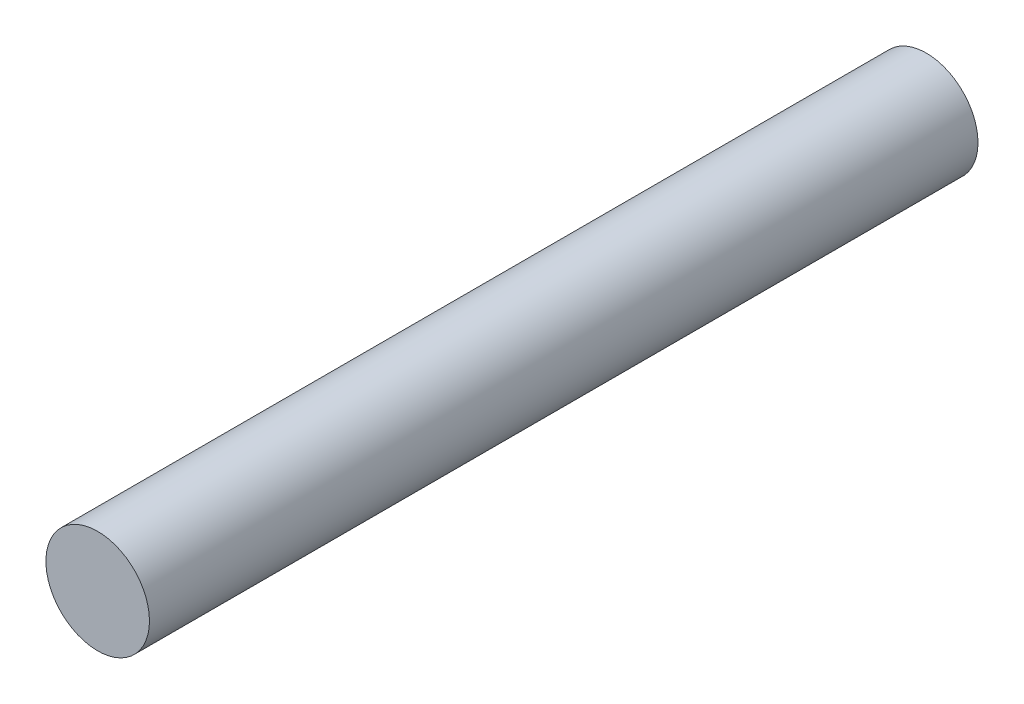
ISO-10303-21;
HEADER;
FILE_DESCRIPTION(('STEP AP214'),'2;1');
FILE_NAME('part.step','',(''),(''),'','','');
FILE_SCHEMA(('AUTOMOTIVE_DESIGN { 1 0 10303 214 1 1 1 1 }'));
ENDSEC;
DATA;
#1=APPLICATION_CONTEXT('core data for automotive mechanical design processes');
#2=APPLICATION_PROTOCOL_DEFINITION('international standard','automotive_design',2000,#1);
#3=PRODUCT_CONTEXT('',#1,'mechanical');
#4=PRODUCT('Part','Part','',(#3));
#5=PRODUCT_RELATED_PRODUCT_CATEGORY('part','',(#4));
#6=PRODUCT_DEFINITION_FORMATION('','',#4);
#7=PRODUCT_DEFINITION_CONTEXT('part definition',#1,'design');
#8=PRODUCT_DEFINITION('design','',#6,#7);
#9=PRODUCT_DEFINITION_SHAPE('','',#8);
#10=(LENGTH_UNIT() NAMED_UNIT(*) SI_UNIT(.MILLI.,.METRE.));
#11=(NAMED_UNIT(*) PLANE_ANGLE_UNIT() SI_UNIT($,.RADIAN.));
#12=(NAMED_UNIT(*) SI_UNIT($,.STERADIAN.) SOLID_ANGLE_UNIT());
#13=UNCERTAINTY_MEASURE_WITH_UNIT(LENGTH_MEASURE(1.E-05),#10,'distance_accuracy_value','');
#14=(GEOMETRIC_REPRESENTATION_CONTEXT(3) GLOBAL_UNCERTAINTY_ASSIGNED_CONTEXT((#13)) GLOBAL_UNIT_ASSIGNED_CONTEXT((#10,
#11,#12)) REPRESENTATION_CONTEXT('',''));
#15=CARTESIAN_POINT('',(0.,0.,0.));
#16=DIRECTION('',(0.,0.,1.));
#17=DIRECTION('',(1.,0.,0.));
#18=AXIS2_PLACEMENT_3D('',#15,#16,#17);
#19=CARTESIAN_POINT('',(0.,0.,20.));
#20=DIRECTION('',(0.,0.,-1.));
#21=DIRECTION('',(-1.,0.,0.));
#22=AXIS2_PLACEMENT_3D('',#19,#20,#21);
#23=CYLINDRICAL_SURFACE('',#22,1.25);
#24=CARTESIAN_POINT('',(0.,0.,20.));
#25=DIRECTION('',(0.,0.,1.));
#26=DIRECTION('',(1.,0.,0.));
#27=AXIS2_PLACEMENT_3D('',#24,#25,#26);
#28=CIRCLE('',#27,1.25);
#29=CARTESIAN_POINT('',(1.25,0.,20.));
#30=VERTEX_POINT('',#29);
#31=EDGE_CURVE('E10',#30,#30,#28,.T.);
#32=ORIENTED_EDGE('',*,*,#31,.F.);
#33=EDGE_LOOP('',(#32));
#34=FACE_BOUND('',#33,.T.);
#35=CARTESIAN_POINT('',(0.,0.,0.));
#36=DIRECTION('',(0.,0.,1.));
#37=DIRECTION('',(1.,0.,0.));
#38=AXIS2_PLACEMENT_3D('',#35,#36,#37);
#39=CIRCLE('',#38,1.25);
#40=CARTESIAN_POINT('',(1.25,0.,0.));
#41=VERTEX_POINT('',#40);
#42=EDGE_CURVE('E34',#41,#41,#39,.T.);
#43=ORIENTED_EDGE('',*,*,#42,.T.);
#44=EDGE_LOOP('',(#43));
#45=FACE_BOUND('',#44,.T.);
#46=ADVANCED_FACE('F31',(#34,#45),#23,.T.);
#47=CARTESIAN_POINT('',(0.,0.,20.));
#48=DIRECTION('',(0.,0.,1.));
#49=DIRECTION('',(1.,0.,0.));
#50=AXIS2_PLACEMENT_3D('',#47,#48,#49);
#51=PLANE('',#50);
#52=ORIENTED_EDGE('',*,*,#31,.T.);
#53=EDGE_LOOP('',(#52));
#54=FACE_BOUND('',#53,.T.);
#55=ADVANCED_FACE('F46',(#54),#51,.T.);
#56=CARTESIAN_POINT('',(0.,0.,0.));
#57=DIRECTION('',(0.,0.,1.));
#58=DIRECTION('',(1.,0.,0.));
#59=AXIS2_PLACEMENT_3D('',#56,#57,#58);
#60=PLANE('',#59);
#61=ORIENTED_EDGE('',*,*,#42,.F.);
#62=EDGE_LOOP('',(#61));
#63=FACE_BOUND('',#62,.T.);
#64=ADVANCED_FACE('F44',(#63),#60,.F.);
#65=CLOSED_SHELL('',(#46,#55,#64));
#66=MANIFOLD_SOLID_BREP('B2',#65);
#67=ADVANCED_BREP_SHAPE_REPRESENTATION('',(#18,#66),#14);
#68=SHAPE_DEFINITION_REPRESENTATION(#9,#67);
ENDSEC;
END-ISO-10303-21;
